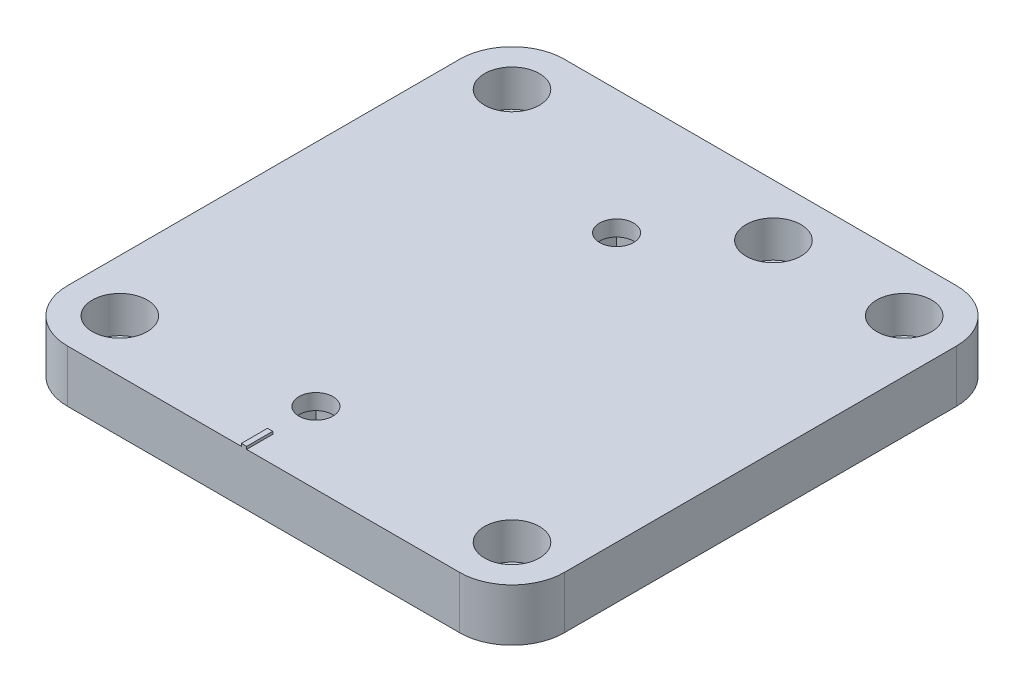
ISO-10303-21;
HEADER;
FILE_DESCRIPTION(('STEP AP214'),'2;1');
FILE_NAME('part.step','',(''),(''),'','','');
FILE_SCHEMA(('AUTOMOTIVE_DESIGN { 1 0 10303 214 1 1 1 1 }'));
ENDSEC;
DATA;
#1=APPLICATION_CONTEXT('core data for automotive mechanical design processes');
#2=APPLICATION_PROTOCOL_DEFINITION('international standard','automotive_design',2000,#1);
#3=PRODUCT_CONTEXT('',#1,'mechanical');
#4=PRODUCT('Part','Part','',(#3));
#5=PRODUCT_RELATED_PRODUCT_CATEGORY('part','',(#4));
#6=PRODUCT_DEFINITION_FORMATION('','',#4);
#7=PRODUCT_DEFINITION_CONTEXT('part definition',#1,'design');
#8=PRODUCT_DEFINITION('design','',#6,#7);
#9=PRODUCT_DEFINITION_SHAPE('','',#8);
#10=(LENGTH_UNIT() NAMED_UNIT(*) SI_UNIT(.MILLI.,.METRE.));
#11=(NAMED_UNIT(*) PLANE_ANGLE_UNIT() SI_UNIT($,.RADIAN.));
#12=(NAMED_UNIT(*) SI_UNIT($,.STERADIAN.) SOLID_ANGLE_UNIT());
#13=UNCERTAINTY_MEASURE_WITH_UNIT(LENGTH_MEASURE(1.E-05),#10,'distance_accuracy_value','');
#14=(GEOMETRIC_REPRESENTATION_CONTEXT(3) GLOBAL_UNCERTAINTY_ASSIGNED_CONTEXT((#13)) GLOBAL_UNIT_ASSIGNED_CONTEXT((#10,
#11,#12)) REPRESENTATION_CONTEXT('',''));
#15=CARTESIAN_POINT('',(0.,0.,0.));
#16=DIRECTION('',(0.,0.,1.));
#17=DIRECTION('',(1.,0.,0.));
#18=AXIS2_PLACEMENT_3D('',#15,#16,#17);
#19=CARTESIAN_POINT('',(-33.75,10.,8.75));
#20=DIRECTION('',(0.,-1.,0.));
#21=DIRECTION('',(0.,0.,-1.));
#22=AXIS2_PLACEMENT_3D('',#19,#20,#21);
#23=CYLINDRICAL_SURFACE('',#22,3.2);
#24=CARTESIAN_POINT('',(-33.75,0.,8.75));
#25=DIRECTION('',(0.,1.,0.));
#26=DIRECTION('',(0.,0.,1.));
#27=AXIS2_PLACEMENT_3D('',#24,#25,#26);
#28=CIRCLE('',#27,3.2);
#29=CARTESIAN_POINT('',(-33.75,0.,11.95));
#30=VERTEX_POINT('',#29);
#31=EDGE_CURVE('E315',#30,#30,#28,.T.);
#32=ORIENTED_EDGE('',*,*,#31,.F.);
#33=EDGE_LOOP('',(#32));
#34=FACE_BOUND('',#33,.T.);
#35=CARTESIAN_POINT('',(-33.75,3.,8.75));
#36=DIRECTION('',(0.,1.,0.));
#37=DIRECTION('',(0.,0.,1.));
#38=AXIS2_PLACEMENT_3D('',#35,#36,#37);
#39=CIRCLE('',#38,3.2);
#40=CARTESIAN_POINT('',(-33.75,3.,11.95));
#41=VERTEX_POINT('',#40);
#42=EDGE_CURVE('E302',#41,#41,#39,.T.);
#43=ORIENTED_EDGE('',*,*,#42,.T.);
#44=EDGE_LOOP('',(#43));
#45=FACE_BOUND('',#44,.T.);
#46=ADVANCED_FACE('F35',(#34,#45),#23,.F.);
#47=CARTESIAN_POINT('',(41.25,10.,8.75));
#48=DIRECTION('',(0.,-1.,0.));
#49=DIRECTION('',(0.,0.,-1.));
#50=AXIS2_PLACEMENT_3D('',#47,#48,#49);
#51=CYLINDRICAL_SURFACE('',#50,3.2);
#52=CARTESIAN_POINT('',(41.25,0.,8.75));
#53=DIRECTION('',(0.,1.,0.));
#54=DIRECTION('',(0.,0.,1.));
#55=AXIS2_PLACEMENT_3D('',#52,#53,#54);
#56=CIRCLE('',#55,3.2);
#57=CARTESIAN_POINT('',(41.25,0.,11.95));
#58=VERTEX_POINT('',#57);
#59=EDGE_CURVE('E312',#58,#58,#56,.T.);
#60=ORIENTED_EDGE('',*,*,#59,.F.);
#61=EDGE_LOOP('',(#60));
#62=FACE_BOUND('',#61,.T.);
#63=CARTESIAN_POINT('',(41.25,3.,8.75));
#64=DIRECTION('',(0.,1.,0.));
#65=DIRECTION('',(0.,0.,1.));
#66=AXIS2_PLACEMENT_3D('',#63,#64,#65);
#67=CIRCLE('',#66,3.2);
#68=CARTESIAN_POINT('',(41.25,3.,11.95));
#69=VERTEX_POINT('',#68);
#70=EDGE_CURVE('E353',#69,#69,#67,.T.);
#71=ORIENTED_EDGE('',*,*,#70,.T.);
#72=EDGE_LOOP('',(#71));
#73=FACE_BOUND('',#72,.T.);
#74=ADVANCED_FACE('F439',(#62,#73),#51,.F.);
#75=CARTESIAN_POINT('',(41.25,10.,83.75));
#76=DIRECTION('',(0.,-1.,0.));
#77=DIRECTION('',(0.,0.,-1.));
#78=AXIS2_PLACEMENT_3D('',#75,#76,#77);
#79=CYLINDRICAL_SURFACE('',#78,3.2);
#80=CARTESIAN_POINT('',(41.25,0.,83.75));
#81=DIRECTION('',(0.,1.,0.));
#82=DIRECTION('',(0.,0.,1.));
#83=AXIS2_PLACEMENT_3D('',#80,#81,#82);
#84=CIRCLE('',#83,3.2);
#85=CARTESIAN_POINT('',(41.25,0.,86.95));
#86=VERTEX_POINT('',#85);
#87=EDGE_CURVE('E309',#86,#86,#84,.T.);
#88=ORIENTED_EDGE('',*,*,#87,.F.);
#89=EDGE_LOOP('',(#88));
#90=FACE_BOUND('',#89,.T.);
#91=CARTESIAN_POINT('',(41.25,3.,83.75));
#92=DIRECTION('',(0.,1.,0.));
#93=DIRECTION('',(0.,0.,1.));
#94=AXIS2_PLACEMENT_3D('',#91,#92,#93);
#95=CIRCLE('',#94,3.2);
#96=CARTESIAN_POINT('',(41.25,3.,86.95));
#97=VERTEX_POINT('',#96);
#98=EDGE_CURVE('E350',#97,#97,#95,.T.);
#99=ORIENTED_EDGE('',*,*,#98,.T.);
#100=EDGE_LOOP('',(#99));
#101=FACE_BOUND('',#100,.T.);
#102=ADVANCED_FACE('F445',(#90,#101),#79,.F.);
#103=CARTESIAN_POINT('',(-33.75,10.,83.75));
#104=DIRECTION('',(0.,-1.,0.));
#105=DIRECTION('',(0.,0.,-1.));
#106=AXIS2_PLACEMENT_3D('',#103,#104,#105);
#107=CYLINDRICAL_SURFACE('',#106,3.19999999999999);
#108=CARTESIAN_POINT('',(-33.75,0.,83.75));
#109=DIRECTION('',(0.,1.,0.));
#110=DIRECTION('',(0.,0.,1.));
#111=AXIS2_PLACEMENT_3D('',#108,#109,#110);
#112=CIRCLE('',#111,3.19999999999999);
#113=CARTESIAN_POINT('',(-33.75,0.,86.95));
#114=VERTEX_POINT('',#113);
#115=EDGE_CURVE('E306',#114,#114,#112,.T.);
#116=ORIENTED_EDGE('',*,*,#115,.F.);
#117=EDGE_LOOP('',(#116));
#118=FACE_BOUND('',#117,.T.);
#119=CARTESIAN_POINT('',(-33.75,3.,83.75));
#120=DIRECTION('',(0.,1.,0.));
#121=DIRECTION('',(0.,0.,1.));
#122=AXIS2_PLACEMENT_3D('',#119,#120,#121);
#123=CIRCLE('',#122,3.19999999999999);
#124=CARTESIAN_POINT('',(-33.75,3.,86.95));
#125=VERTEX_POINT('',#124);
#126=EDGE_CURVE('E281',#125,#125,#123,.T.);
#127=ORIENTED_EDGE('',*,*,#126,.T.);
#128=EDGE_LOOP('',(#127));
#129=FACE_BOUND('',#128,.T.);
#130=ADVANCED_FACE('F455',(#118,#129),#107,.F.);
#131=CARTESIAN_POINT('',(16.25,10.,8.75));
#132=DIRECTION('',(0.,-1.,0.));
#133=DIRECTION('',(0.,0.,-1.));
#134=AXIS2_PLACEMENT_3D('',#131,#132,#133);
#135=CYLINDRICAL_SURFACE('',#134,3.2);
#136=CARTESIAN_POINT('',(16.25,0.,8.75));
#137=DIRECTION('',(0.,1.,0.));
#138=DIRECTION('',(0.,0.,1.));
#139=AXIS2_PLACEMENT_3D('',#136,#137,#138);
#140=CIRCLE('',#139,3.2);
#141=CARTESIAN_POINT('',(16.25,0.,11.95));
#142=VERTEX_POINT('',#141);
#143=EDGE_CURVE('E318',#142,#142,#140,.T.);
#144=ORIENTED_EDGE('',*,*,#143,.F.);
#145=EDGE_LOOP('',(#144));
#146=FACE_BOUND('',#145,.T.);
#147=CARTESIAN_POINT('',(16.25,3.,8.75));
#148=DIRECTION('',(0.,1.,0.));
#149=DIRECTION('',(0.,0.,1.));
#150=AXIS2_PLACEMENT_3D('',#147,#148,#149);
#151=CIRCLE('',#150,3.2);
#152=CARTESIAN_POINT('',(16.25,3.,11.95));
#153=VERTEX_POINT('',#152);
#154=EDGE_CURVE('E305',#153,#153,#151,.T.);
#155=ORIENTED_EDGE('',*,*,#154,.T.);
#156=EDGE_LOOP('',(#155));
#157=FACE_BOUND('',#156,.T.);
#158=ADVANCED_FACE('F452',(#146,#157),#135,.F.);
#159=CARTESIAN_POINT('',(0.,10.,0.));
#160=DIRECTION('',(0.,1.,0.));
#161=DIRECTION('',(0.,0.,1.));
#162=AXIS2_PLACEMENT_3D('',#159,#160,#161);
#163=PLANE('',#162);
#164=DIRECTION('',(0.,0.,-1.));
#165=VECTOR('',#164,1.);
#166=CARTESIAN_POINT('',(0.5,10.,93.75));
#167=LINE('',#166,#165);
#168=CARTESIAN_POINT('',(0.5,10.,93.75));
#169=VERTEX_POINT('',#168);
#170=CARTESIAN_POINT('',(0.5,10.,88.75));
#171=VERTEX_POINT('',#170);
#172=EDGE_CURVE('E55',#169,#171,#167,.T.);
#173=ORIENTED_EDGE('',*,*,#172,.F.);
#174=DIRECTION('',(1.,0.,0.));
#175=VECTOR('',#174,1.);
#176=CARTESIAN_POINT('',(-43.75,10.,93.75));
#177=LINE('',#176,#175);
#178=CARTESIAN_POINT('',(41.25,10.,93.75));
#179=VERTEX_POINT('',#178);
#180=EDGE_CURVE('E329',#169,#179,#177,.T.);
#181=ORIENTED_EDGE('',*,*,#180,.T.);
#182=CARTESIAN_POINT('',(41.25,10.,83.75));
#183=DIRECTION('',(0.,1.,0.));
#184=DIRECTION('',(0.,0.,1.));
#185=AXIS2_PLACEMENT_3D('',#182,#183,#184);
#186=CIRCLE('',#185,10.);
#187=CARTESIAN_POINT('',(51.25,10.,83.75));
#188=VERTEX_POINT('',#187);
#189=EDGE_CURVE('E377',#179,#188,#186,.T.);
#190=ORIENTED_EDGE('',*,*,#189,.T.);
#191=DIRECTION('',(0.,0.,-1.));
#192=VECTOR('',#191,1.);
#193=CARTESIAN_POINT('',(51.25,10.,-1.25000000000001));
#194=LINE('',#193,#192);
#195=CARTESIAN_POINT('',(51.25,10.,8.74999999999999));
#196=VERTEX_POINT('',#195);
#197=EDGE_CURVE('E332',#188,#196,#194,.T.);
#198=ORIENTED_EDGE('',*,*,#197,.T.);
#199=CARTESIAN_POINT('',(41.25,10.,8.74999999999999));
#200=DIRECTION('',(0.,1.,0.));
#201=DIRECTION('',(0.,0.,1.));
#202=AXIS2_PLACEMENT_3D('',#199,#200,#201);
#203=CIRCLE('',#202,10.);
#204=CARTESIAN_POINT('',(41.25,10.,-1.25000000000001));
#205=VERTEX_POINT('',#204);
#206=EDGE_CURVE('E381',#196,#205,#203,.T.);
#207=ORIENTED_EDGE('',*,*,#206,.T.);
#208=DIRECTION('',(-1.,0.,0.));
#209=VECTOR('',#208,1.);
#210=CARTESIAN_POINT('',(51.25,10.,-1.25000000000001));
#211=LINE('',#210,#209);
#212=CARTESIAN_POINT('',(-33.75,10.,-1.25));
#213=VERTEX_POINT('',#212);
#214=EDGE_CURVE('E322',#205,#213,#211,.T.);
#215=ORIENTED_EDGE('',*,*,#214,.T.);
#216=CARTESIAN_POINT('',(-33.75,10.,8.75));
#217=DIRECTION('',(0.,1.,0.));
#218=DIRECTION('',(0.,0.,1.));
#219=AXIS2_PLACEMENT_3D('',#216,#217,#218);
#220=CIRCLE('',#219,10.);
#221=CARTESIAN_POINT('',(-43.75,10.,8.75));
#222=VERTEX_POINT('',#221);
#223=EDGE_CURVE('E379',#213,#222,#220,.T.);
#224=ORIENTED_EDGE('',*,*,#223,.T.);
#225=DIRECTION('',(0.,0.,1.));
#226=VECTOR('',#225,1.);
#227=CARTESIAN_POINT('',(-43.75,10.,-1.25));
#228=LINE('',#227,#226);
#229=CARTESIAN_POINT('',(-43.75,10.,83.75));
#230=VERTEX_POINT('',#229);
#231=EDGE_CURVE('E325',#222,#230,#228,.T.);
#232=ORIENTED_EDGE('',*,*,#231,.T.);
#233=CARTESIAN_POINT('',(-33.75,10.,83.75));
#234=DIRECTION('',(0.,1.,0.));
#235=DIRECTION('',(0.,0.,1.));
#236=AXIS2_PLACEMENT_3D('',#233,#234,#235);
#237=CIRCLE('',#236,10.);
#238=CARTESIAN_POINT('',(-33.75,10.,93.75));
#239=VERTEX_POINT('',#238);
#240=EDGE_CURVE('E375',#230,#239,#237,.T.);
#241=ORIENTED_EDGE('',*,*,#240,.T.);
#242=CARTESIAN_POINT('',(-0.5,10.,93.75));
#243=VERTEX_POINT('',#242);
#244=EDGE_CURVE('E330',#239,#243,#177,.T.);
#245=ORIENTED_EDGE('',*,*,#244,.T.);
#246=DIRECTION('',(0.,0.,1.));
#247=VECTOR('',#246,1.);
#248=CARTESIAN_POINT('',(-0.5,10.,93.75));
#249=LINE('',#248,#247);
#250=CARTESIAN_POINT('',(-0.5,10.,88.75));
#251=VERTEX_POINT('',#250);
#252=EDGE_CURVE('E189',#251,#243,#249,.T.);
#253=ORIENTED_EDGE('',*,*,#252,.F.);
#254=DIRECTION('',(-1.,0.,0.));
#255=VECTOR('',#254,1.);
#256=CARTESIAN_POINT('',(0.5,10.,88.75));
#257=LINE('',#256,#255);
#258=EDGE_CURVE('E50',#171,#251,#257,.T.);
#259=ORIENTED_EDGE('',*,*,#258,.F.);
#260=EDGE_LOOP('',(#173,#181,#190,#198,#207,#215,#224,#232,#241,#245,#253,#259));
#261=FACE_BOUND('',#260,.T.);
#262=CARTESIAN_POINT('',(0.,10.,80.));
#263=DIRECTION('',(0.,1.,0.));
#264=DIRECTION('',(0.,0.,1.));
#265=AXIS2_PLACEMENT_3D('',#262,#263,#264);
#266=CIRCLE('',#265,3.25);
#267=CARTESIAN_POINT('',(0.,10.,83.25));
#268=VERTEX_POINT('',#267);
#269=EDGE_CURVE('E248',#268,#268,#266,.T.);
#270=ORIENTED_EDGE('',*,*,#269,.F.);
#271=EDGE_LOOP('',(#270));
#272=FACE_BOUND('',#271,.T.);
#273=CARTESIAN_POINT('',(0.,10.,22.5));
#274=DIRECTION('',(0.,1.,0.));
#275=DIRECTION('',(0.,0.,1.));
#276=AXIS2_PLACEMENT_3D('',#273,#274,#275);
#277=CIRCLE('',#276,3.25);
#278=CARTESIAN_POINT('',(0.,10.,25.75));
#279=VERTEX_POINT('',#278);
#280=EDGE_CURVE('E270',#279,#279,#277,.T.);
#281=ORIENTED_EDGE('',*,*,#280,.F.);
#282=EDGE_LOOP('',(#281));
#283=FACE_BOUND('',#282,.T.);
#284=CARTESIAN_POINT('',(-33.75,10.,8.75));
#285=DIRECTION('',(0.,1.,0.));
#286=DIRECTION('',(0.,0.,1.));
#287=AXIS2_PLACEMENT_3D('',#284,#285,#286);
#288=CIRCLE('',#287,5.25);
#289=CARTESIAN_POINT('',(-33.75,10.,14.));
#290=VERTEX_POINT('',#289);
#291=EDGE_CURVE('E274',#290,#290,#288,.T.);
#292=ORIENTED_EDGE('',*,*,#291,.F.);
#293=EDGE_LOOP('',(#292));
#294=FACE_BOUND('',#293,.T.);
#295=CARTESIAN_POINT('',(41.25,10.,8.75));
#296=DIRECTION('',(0.,1.,0.));
#297=DIRECTION('',(0.,0.,1.));
#298=AXIS2_PLACEMENT_3D('',#295,#296,#297);
#299=CIRCLE('',#298,5.25);
#300=CARTESIAN_POINT('',(41.25,10.,14.));
#301=VERTEX_POINT('',#300);
#302=EDGE_CURVE('E282',#301,#301,#299,.T.);
#303=ORIENTED_EDGE('',*,*,#302,.F.);
#304=EDGE_LOOP('',(#303));
#305=FACE_BOUND('',#304,.T.);
#306=CARTESIAN_POINT('',(41.25,10.,83.75));
#307=DIRECTION('',(0.,1.,0.));
#308=DIRECTION('',(0.,0.,1.));
#309=AXIS2_PLACEMENT_3D('',#306,#307,#308);
#310=CIRCLE('',#309,5.25);
#311=CARTESIAN_POINT('',(41.25,10.,89.));
#312=VERTEX_POINT('',#311);
#313=EDGE_CURVE('E288',#312,#312,#310,.T.);
#314=ORIENTED_EDGE('',*,*,#313,.F.);
#315=EDGE_LOOP('',(#314));
#316=FACE_BOUND('',#315,.T.);
#317=CARTESIAN_POINT('',(-33.75,10.,83.75));
#318=DIRECTION('',(0.,1.,0.));
#319=DIRECTION('',(0.,0.,1.));
#320=AXIS2_PLACEMENT_3D('',#317,#318,#319);
#321=CIRCLE('',#320,5.25);
#322=CARTESIAN_POINT('',(-33.75,10.,89.));
#323=VERTEX_POINT('',#322);
#324=EDGE_CURVE('E273',#323,#323,#321,.T.);
#325=ORIENTED_EDGE('',*,*,#324,.F.);
#326=EDGE_LOOP('',(#325));
#327=FACE_BOUND('',#326,.T.);
#328=CARTESIAN_POINT('',(16.25,10.,8.75));
#329=DIRECTION('',(0.,1.,0.));
#330=DIRECTION('',(0.,0.,1.));
#331=AXIS2_PLACEMENT_3D('',#328,#329,#330);
#332=CIRCLE('',#331,5.25);
#333=CARTESIAN_POINT('',(16.25,10.,14.));
#334=VERTEX_POINT('',#333);
#335=EDGE_CURVE('E298',#334,#334,#332,.T.);
#336=ORIENTED_EDGE('',*,*,#335,.F.);
#337=EDGE_LOOP('',(#336));
#338=FACE_BOUND('',#337,.T.);
#339=ADVANCED_FACE('F412',(#261,#272,#283,#294,#305,#316,#327,#338),#163,.T.);
#340=CARTESIAN_POINT('',(0.,0.,0.));
#341=DIRECTION('',(0.,1.,0.));
#342=DIRECTION('',(0.,0.,1.));
#343=AXIS2_PLACEMENT_3D('',#340,#341,#342);
#344=PLANE('',#343);
#345=DIRECTION('',(1.,0.,0.));
#346=VECTOR('',#345,1.);
#347=CARTESIAN_POINT('',(-5.19999999999999,0.,74.8));
#348=LINE('',#347,#346);
#349=CARTESIAN_POINT('',(-5.19999999999999,0.,74.8));
#350=VERTEX_POINT('',#349);
#351=CARTESIAN_POINT('',(5.19999999999999,0.,74.8));
#352=VERTEX_POINT('',#351);
#353=EDGE_CURVE('E208',#350,#352,#348,.T.);
#354=ORIENTED_EDGE('',*,*,#353,.F.);
#355=DIRECTION('',(0.,0.,-1.));
#356=VECTOR('',#355,1.);
#357=CARTESIAN_POINT('',(-5.19999999999999,0.,74.8));
#358=LINE('',#357,#356);
#359=CARTESIAN_POINT('',(-5.19999999999999,0.,85.2));
#360=VERTEX_POINT('',#359);
#361=EDGE_CURVE('E211',#360,#350,#358,.T.);
#362=ORIENTED_EDGE('',*,*,#361,.F.);
#363=DIRECTION('',(-1.,0.,0.));
#364=VECTOR('',#363,1.);
#365=CARTESIAN_POINT('',(-5.19999999999999,0.,85.2));
#366=LINE('',#365,#364);
#367=CARTESIAN_POINT('',(5.19999999999999,0.,85.2));
#368=VERTEX_POINT('',#367);
#369=EDGE_CURVE('E201',#368,#360,#366,.T.);
#370=ORIENTED_EDGE('',*,*,#369,.F.);
#371=DIRECTION('',(0.,0.,1.));
#372=VECTOR('',#371,1.);
#373=CARTESIAN_POINT('',(5.19999999999999,0.,74.8));
#374=LINE('',#373,#372);
#375=EDGE_CURVE('E205',#352,#368,#374,.T.);
#376=ORIENTED_EDGE('',*,*,#375,.F.);
#377=EDGE_LOOP('',(#354,#362,#370,#376));
#378=FACE_BOUND('',#377,.T.);
#379=DIRECTION('',(-1.,0.,0.));
#380=VECTOR('',#379,1.);
#381=CARTESIAN_POINT('',(5.2,0.,27.7));
#382=LINE('',#381,#380);
#383=CARTESIAN_POINT('',(5.2,0.,27.7));
#384=VERTEX_POINT('',#383);
#385=CARTESIAN_POINT('',(-5.2,0.,27.7));
#386=VERTEX_POINT('',#385);
#387=EDGE_CURVE('E240',#384,#386,#382,.T.);
#388=ORIENTED_EDGE('',*,*,#387,.F.);
#389=DIRECTION('',(0.,0.,1.));
#390=VECTOR('',#389,1.);
#391=CARTESIAN_POINT('',(5.2,0.,27.7));
#392=LINE('',#391,#390);
#393=CARTESIAN_POINT('',(5.2,0.,17.3));
#394=VERTEX_POINT('',#393);
#395=EDGE_CURVE('E243',#394,#384,#392,.T.);
#396=ORIENTED_EDGE('',*,*,#395,.F.);
#397=DIRECTION('',(1.,0.,0.));
#398=VECTOR('',#397,1.);
#399=CARTESIAN_POINT('',(5.2,0.,17.3));
#400=LINE('',#399,#398);
#401=CARTESIAN_POINT('',(-5.2,0.,17.3));
#402=VERTEX_POINT('',#401);
#403=EDGE_CURVE('E233',#402,#394,#400,.T.);
#404=ORIENTED_EDGE('',*,*,#403,.F.);
#405=DIRECTION('',(0.,0.,-1.));
#406=VECTOR('',#405,1.);
#407=CARTESIAN_POINT('',(-5.2,0.,27.7));
#408=LINE('',#407,#406);
#409=EDGE_CURVE('E237',#386,#402,#408,.T.);
#410=ORIENTED_EDGE('',*,*,#409,.F.);
#411=EDGE_LOOP('',(#388,#396,#404,#410));
#412=FACE_BOUND('',#411,.T.);
#413=DIRECTION('',(-1.,0.,0.));
#414=VECTOR('',#413,1.);
#415=CARTESIAN_POINT('',(51.25,0.,-1.25000000000001));
#416=LINE('',#415,#414);
#417=CARTESIAN_POINT('',(41.25,0.,-1.25000000000001));
#418=VERTEX_POINT('',#417);
#419=CARTESIAN_POINT('',(-33.75,0.,-1.25));
#420=VERTEX_POINT('',#419);
#421=EDGE_CURVE('E321',#418,#420,#416,.T.);
#422=ORIENTED_EDGE('',*,*,#421,.F.);
#423=CARTESIAN_POINT('',(41.25,0.,8.74999999999999));
#424=DIRECTION('',(0.,1.,0.));
#425=DIRECTION('',(0.,0.,1.));
#426=AXIS2_PLACEMENT_3D('',#423,#424,#425);
#427=CIRCLE('',#426,10.);
#428=CARTESIAN_POINT('',(51.25,0.,8.74999999999999));
#429=VERTEX_POINT('',#428);
#430=EDGE_CURVE('E368',#418,#429,#427,.F.);
#431=ORIENTED_EDGE('',*,*,#430,.T.);
#432=DIRECTION('',(0.,0.,-1.));
#433=VECTOR('',#432,1.);
#434=CARTESIAN_POINT('',(51.25,0.,-1.25000000000001));
#435=LINE('',#434,#433);
#436=CARTESIAN_POINT('',(51.25,0.,83.75));
#437=VERTEX_POINT('',#436);
#438=EDGE_CURVE('E326',#437,#429,#435,.T.);
#439=ORIENTED_EDGE('',*,*,#438,.F.);
#440=CARTESIAN_POINT('',(41.25,0.,83.75));
#441=DIRECTION('',(0.,1.,0.));
#442=DIRECTION('',(0.,0.,1.));
#443=AXIS2_PLACEMENT_3D('',#440,#441,#442);
#444=CIRCLE('',#443,10.);
#445=CARTESIAN_POINT('',(41.25,0.,93.75));
#446=VERTEX_POINT('',#445);
#447=EDGE_CURVE('E364',#437,#446,#444,.F.);
#448=ORIENTED_EDGE('',*,*,#447,.T.);
#449=DIRECTION('',(1.,0.,0.));
#450=VECTOR('',#449,1.);
#451=CARTESIAN_POINT('',(-43.75,0.,93.75));
#452=LINE('',#451,#450);
#453=CARTESIAN_POINT('',(-33.75,0.,93.75));
#454=VERTEX_POINT('',#453);
#455=EDGE_CURVE('E341',#454,#446,#452,.T.);
#456=ORIENTED_EDGE('',*,*,#455,.F.);
#457=CARTESIAN_POINT('',(-33.75,0.,83.75));
#458=DIRECTION('',(0.,1.,0.));
#459=DIRECTION('',(0.,0.,1.));
#460=AXIS2_PLACEMENT_3D('',#457,#458,#459);
#461=CIRCLE('',#460,10.);
#462=CARTESIAN_POINT('',(-43.75,0.,83.75));
#463=VERTEX_POINT('',#462);
#464=EDGE_CURVE('E362',#454,#463,#461,.F.);
#465=ORIENTED_EDGE('',*,*,#464,.T.);
#466=DIRECTION('',(0.,0.,1.));
#467=VECTOR('',#466,1.);
#468=CARTESIAN_POINT('',(-43.75,0.,-1.25));
#469=LINE('',#468,#467);
#470=CARTESIAN_POINT('',(-43.75,0.,8.75));
#471=VERTEX_POINT('',#470);
#472=EDGE_CURVE('E338',#471,#463,#469,.T.);
#473=ORIENTED_EDGE('',*,*,#472,.F.);
#474=CARTESIAN_POINT('',(-33.75,0.,8.75));
#475=DIRECTION('',(0.,1.,0.));
#476=DIRECTION('',(0.,0.,1.));
#477=AXIS2_PLACEMENT_3D('',#474,#475,#476);
#478=CIRCLE('',#477,10.);
#479=EDGE_CURVE('E366',#471,#420,#478,.F.);
#480=ORIENTED_EDGE('',*,*,#479,.T.);
#481=EDGE_LOOP('',(#422,#431,#439,#448,#456,#465,#473,#480));
#482=FACE_BOUND('',#481,.T.);
#483=ORIENTED_EDGE('',*,*,#143,.T.);
#484=EDGE_LOOP('',(#483));
#485=FACE_BOUND('',#484,.T.);
#486=ORIENTED_EDGE('',*,*,#31,.T.);
#487=EDGE_LOOP('',(#486));
#488=FACE_BOUND('',#487,.T.);
#489=ORIENTED_EDGE('',*,*,#59,.T.);
#490=EDGE_LOOP('',(#489));
#491=FACE_BOUND('',#490,.T.);
#492=ORIENTED_EDGE('',*,*,#87,.T.);
#493=EDGE_LOOP('',(#492));
#494=FACE_BOUND('',#493,.T.);
#495=ORIENTED_EDGE('',*,*,#115,.T.);
#496=EDGE_LOOP('',(#495));
#497=FACE_BOUND('',#496,.T.);
#498=ADVANCED_FACE('F399',(#378,#412,#482,#485,#488,#491,#494,#497),#344,.F.);
#499=CARTESIAN_POINT('',(51.25,10.,-1.25000000000001));
#500=DIRECTION('',(0.,0.,1.));
#501=DIRECTION('',(1.,0.,0.));
#502=AXIS2_PLACEMENT_3D('',#499,#500,#501);
#503=PLANE('',#502);
#504=ORIENTED_EDGE('',*,*,#214,.F.);
#505=DIRECTION('',(0.,-1.,0.));
#506=VECTOR('',#505,1.);
#507=CARTESIAN_POINT('',(41.25,10.,-1.25000000000001));
#508=LINE('',#507,#506);
#509=EDGE_CURVE('E359',#205,#418,#508,.T.);
#510=ORIENTED_EDGE('',*,*,#509,.T.);
#511=ORIENTED_EDGE('',*,*,#421,.T.);
#512=DIRECTION('',(0.,-1.,0.));
#513=VECTOR('',#512,1.);
#514=CARTESIAN_POINT('',(-33.75,10.,-1.25));
#515=LINE('',#514,#513);
#516=EDGE_CURVE('E335',#420,#213,#515,.F.);
#517=ORIENTED_EDGE('',*,*,#516,.T.);
#518=EDGE_LOOP('',(#504,#510,#511,#517));
#519=FACE_BOUND('',#518,.T.);
#520=ADVANCED_FACE('F419',(#519),#503,.F.);
#521=CARTESIAN_POINT('',(-43.75,10.,-1.25));
#522=DIRECTION('',(1.,0.,0.));
#523=DIRECTION('',(0.,0.,-1.));
#524=AXIS2_PLACEMENT_3D('',#521,#522,#523);
#525=PLANE('',#524);
#526=ORIENTED_EDGE('',*,*,#231,.F.);
#527=DIRECTION('',(0.,-1.,0.));
#528=VECTOR('',#527,1.);
#529=CARTESIAN_POINT('',(-43.75,10.,8.75));
#530=LINE('',#529,#528);
#531=EDGE_CURVE('E385',#222,#471,#530,.T.);
#532=ORIENTED_EDGE('',*,*,#531,.T.);
#533=ORIENTED_EDGE('',*,*,#472,.T.);
#534=DIRECTION('',(0.,-1.,0.));
#535=VECTOR('',#534,1.);
#536=CARTESIAN_POINT('',(-43.75,10.,83.75));
#537=LINE('',#536,#535);
#538=EDGE_CURVE('E383',#463,#230,#537,.F.);
#539=ORIENTED_EDGE('',*,*,#538,.T.);
#540=EDGE_LOOP('',(#526,#532,#533,#539));
#541=FACE_BOUND('',#540,.T.);
#542=ADVANCED_FACE('F427',(#541),#525,.F.);
#543=CARTESIAN_POINT('',(-43.75,10.,93.75));
#544=DIRECTION('',(0.,0.,-1.));
#545=DIRECTION('',(-1.,0.,0.));
#546=AXIS2_PLACEMENT_3D('',#543,#544,#545);
#547=PLANE('',#546);
#548=ORIENTED_EDGE('',*,*,#455,.T.);
#549=DIRECTION('',(0.,-1.,0.));
#550=VECTOR('',#549,1.);
#551=CARTESIAN_POINT('',(41.25,10.,93.75));
#552=LINE('',#551,#550);
#553=EDGE_CURVE('E12',#446,#179,#552,.F.);
#554=ORIENTED_EDGE('',*,*,#553,.T.);
#555=ORIENTED_EDGE('',*,*,#180,.F.);
#556=DIRECTION('',(0.,-1.,0.));
#557=VECTOR('',#556,1.);
#558=CARTESIAN_POINT('',(0.5,10.5,93.75));
#559=LINE('',#558,#557);
#560=CARTESIAN_POINT('',(0.5,10.5,93.75));
#561=VERTEX_POINT('',#560);
#562=EDGE_CURVE('E857',#561,#169,#559,.T.);
#563=ORIENTED_EDGE('',*,*,#562,.F.);
#564=DIRECTION('',(1.,0.,0.));
#565=VECTOR('',#564,1.);
#566=CARTESIAN_POINT('',(0.5,10.5,93.75));
#567=LINE('',#566,#565);
#568=CARTESIAN_POINT('',(-0.5,10.5,93.75));
#569=VERTEX_POINT('',#568);
#570=EDGE_CURVE('E185',#569,#561,#567,.T.);
#571=ORIENTED_EDGE('',*,*,#570,.F.);
#572=DIRECTION('',(0.,-1.,0.));
#573=VECTOR('',#572,1.);
#574=CARTESIAN_POINT('',(-0.5,10.5,93.75));
#575=LINE('',#574,#573);
#576=EDGE_CURVE('E197',#569,#243,#575,.T.);
#577=ORIENTED_EDGE('',*,*,#576,.T.);
#578=ORIENTED_EDGE('',*,*,#244,.F.);
#579=DIRECTION('',(0.,-1.,0.));
#580=VECTOR('',#579,1.);
#581=CARTESIAN_POINT('',(-33.75,10.,93.75));
#582=LINE('',#581,#580);
#583=EDGE_CURVE('E43',#239,#454,#582,.T.);
#584=ORIENTED_EDGE('',*,*,#583,.T.);
#585=EDGE_LOOP('',(#548,#554,#555,#563,#571,#577,#578,#584));
#586=FACE_BOUND('',#585,.T.);
#587=ADVANCED_FACE('F392',(#586),#547,.F.);
#588=CARTESIAN_POINT('',(51.25,10.,-1.25000000000001));
#589=DIRECTION('',(-1.,0.,0.));
#590=DIRECTION('',(0.,0.,1.));
#591=AXIS2_PLACEMENT_3D('',#588,#589,#590);
#592=PLANE('',#591);
#593=ORIENTED_EDGE('',*,*,#438,.T.);
#594=DIRECTION('',(0.,-1.,0.));
#595=VECTOR('',#594,1.);
#596=CARTESIAN_POINT('',(51.25,10.,8.74999999999999));
#597=LINE('',#596,#595);
#598=EDGE_CURVE('E373',#429,#196,#597,.F.);
#599=ORIENTED_EDGE('',*,*,#598,.T.);
#600=ORIENTED_EDGE('',*,*,#197,.F.);
#601=DIRECTION('',(0.,-1.,0.));
#602=VECTOR('',#601,1.);
#603=CARTESIAN_POINT('',(51.25,10.,83.75));
#604=LINE('',#603,#602);
#605=EDGE_CURVE('E370',#188,#437,#604,.T.);
#606=ORIENTED_EDGE('',*,*,#605,.T.);
#607=EDGE_LOOP('',(#593,#599,#600,#606));
#608=FACE_BOUND('',#607,.T.);
#609=ADVANCED_FACE('F409',(#608),#592,.F.);
#610=CARTESIAN_POINT('',(16.25,-14.8492424049175,8.75));
#611=DIRECTION('',(0.,1.,0.));
#612=DIRECTION('',(0.,0.,1.));
#613=AXIS2_PLACEMENT_3D('',#610,#611,#612);
#614=CYLINDRICAL_SURFACE('',#613,5.25);
#615=CARTESIAN_POINT('',(16.25,3.,8.75));
#616=DIRECTION('',(0.,1.,0.));
#617=DIRECTION('',(0.,0.,1.));
#618=AXIS2_PLACEMENT_3D('',#615,#616,#617);
#619=CIRCLE('',#618,5.25);
#620=CARTESIAN_POINT('',(16.25,3.,14.));
#621=VERTEX_POINT('',#620);
#622=EDGE_CURVE('E301',#621,#621,#619,.F.);
#623=ORIENTED_EDGE('',*,*,#622,.T.);
#624=EDGE_LOOP('',(#623));
#625=FACE_BOUND('',#624,.T.);
#626=ORIENTED_EDGE('',*,*,#335,.T.);
#627=EDGE_LOOP('',(#626));
#628=FACE_BOUND('',#627,.T.);
#629=ADVANCED_FACE('F464',(#625,#628),#614,.F.);
#630=CARTESIAN_POINT('',(0.,3.,0.));
#631=DIRECTION('',(0.,1.,0.));
#632=DIRECTION('',(0.,0.,1.));
#633=AXIS2_PLACEMENT_3D('',#630,#631,#632);
#634=PLANE('',#633);
#635=ORIENTED_EDGE('',*,*,#154,.F.);
#636=EDGE_LOOP('',(#635));
#637=FACE_BOUND('',#636,.T.);
#638=ORIENTED_EDGE('',*,*,#622,.F.);
#639=EDGE_LOOP('',(#638));
#640=FACE_BOUND('',#639,.T.);
#641=ADVANCED_FACE('F691',(#637,#640),#634,.T.);
#642=CARTESIAN_POINT('',(-33.75,-14.8492424049175,83.75));
#643=DIRECTION('',(0.,1.,0.));
#644=DIRECTION('',(0.,0.,1.));
#645=AXIS2_PLACEMENT_3D('',#642,#643,#644);
#646=CYLINDRICAL_SURFACE('',#645,5.25);
#647=CARTESIAN_POINT('',(-33.75,3.,83.75));
#648=DIRECTION('',(0.,1.,0.));
#649=DIRECTION('',(0.,0.,1.));
#650=AXIS2_PLACEMENT_3D('',#647,#648,#649);
#651=CIRCLE('',#650,5.25);
#652=CARTESIAN_POINT('',(-33.75,3.,89.));
#653=VERTEX_POINT('',#652);
#654=EDGE_CURVE('E291',#653,#653,#651,.F.);
#655=ORIENTED_EDGE('',*,*,#654,.T.);
#656=EDGE_LOOP('',(#655));
#657=FACE_BOUND('',#656,.T.);
#658=ORIENTED_EDGE('',*,*,#324,.T.);
#659=EDGE_LOOP('',(#658));
#660=FACE_BOUND('',#659,.T.);
#661=ADVANCED_FACE('F687',(#657,#660),#646,.F.);
#662=CARTESIAN_POINT('',(0.,3.,0.));
#663=DIRECTION('',(0.,1.,0.));
#664=DIRECTION('',(0.,0.,1.));
#665=AXIS2_PLACEMENT_3D('',#662,#663,#664);
#666=PLANE('',#665);
#667=ORIENTED_EDGE('',*,*,#126,.F.);
#668=EDGE_LOOP('',(#667));
#669=FACE_BOUND('',#668,.T.);
#670=ORIENTED_EDGE('',*,*,#654,.F.);
#671=EDGE_LOOP('',(#670));
#672=FACE_BOUND('',#671,.T.);
#673=ADVANCED_FACE('F683',(#669,#672),#666,.T.);
#674=CARTESIAN_POINT('',(41.25,-14.8492424049175,83.75));
#675=DIRECTION('',(0.,1.,0.));
#676=DIRECTION('',(0.,0.,1.));
#677=AXIS2_PLACEMENT_3D('',#674,#675,#676);
#678=CYLINDRICAL_SURFACE('',#677,5.25);
#679=CARTESIAN_POINT('',(41.25,3.,83.75));
#680=DIRECTION('',(0.,1.,0.));
#681=DIRECTION('',(0.,0.,1.));
#682=AXIS2_PLACEMENT_3D('',#679,#680,#681);
#683=CIRCLE('',#682,5.25);
#684=CARTESIAN_POINT('',(41.25,3.,89.));
#685=VERTEX_POINT('',#684);
#686=EDGE_CURVE('E285',#685,#685,#683,.F.);
#687=ORIENTED_EDGE('',*,*,#686,.T.);
#688=EDGE_LOOP('',(#687));
#689=FACE_BOUND('',#688,.T.);
#690=ORIENTED_EDGE('',*,*,#313,.T.);
#691=EDGE_LOOP('',(#690));
#692=FACE_BOUND('',#691,.T.);
#693=ADVANCED_FACE('F679',(#689,#692),#678,.F.);
#694=CARTESIAN_POINT('',(0.,3.,0.));
#695=DIRECTION('',(0.,1.,0.));
#696=DIRECTION('',(0.,0.,1.));
#697=AXIS2_PLACEMENT_3D('',#694,#695,#696);
#698=PLANE('',#697);
#699=ORIENTED_EDGE('',*,*,#98,.F.);
#700=EDGE_LOOP('',(#699));
#701=FACE_BOUND('',#700,.T.);
#702=ORIENTED_EDGE('',*,*,#686,.F.);
#703=EDGE_LOOP('',(#702));
#704=FACE_BOUND('',#703,.T.);
#705=ADVANCED_FACE('F675',(#701,#704),#698,.T.);
#706=CARTESIAN_POINT('',(41.25,-14.8492424049175,8.75));
#707=DIRECTION('',(0.,1.,0.));
#708=DIRECTION('',(0.,0.,1.));
#709=AXIS2_PLACEMENT_3D('',#706,#707,#708);
#710=CYLINDRICAL_SURFACE('',#709,5.25);
#711=CARTESIAN_POINT('',(41.25,3.,8.75));
#712=DIRECTION('',(0.,1.,0.));
#713=DIRECTION('',(0.,0.,1.));
#714=AXIS2_PLACEMENT_3D('',#711,#712,#713);
#715=CIRCLE('',#714,5.25);
#716=CARTESIAN_POINT('',(41.25,3.,14.));
#717=VERTEX_POINT('',#716);
#718=EDGE_CURVE('E278',#717,#717,#715,.F.);
#719=ORIENTED_EDGE('',*,*,#718,.T.);
#720=EDGE_LOOP('',(#719));
#721=FACE_BOUND('',#720,.T.);
#722=ORIENTED_EDGE('',*,*,#302,.T.);
#723=EDGE_LOOP('',(#722));
#724=FACE_BOUND('',#723,.T.);
#725=ADVANCED_FACE('F671',(#721,#724),#710,.F.);
#726=CARTESIAN_POINT('',(0.,3.,0.));
#727=DIRECTION('',(0.,1.,0.));
#728=DIRECTION('',(0.,0.,1.));
#729=AXIS2_PLACEMENT_3D('',#726,#727,#728);
#730=PLANE('',#729);
#731=ORIENTED_EDGE('',*,*,#70,.F.);
#732=EDGE_LOOP('',(#731));
#733=FACE_BOUND('',#732,.T.);
#734=ORIENTED_EDGE('',*,*,#718,.F.);
#735=EDGE_LOOP('',(#734));
#736=FACE_BOUND('',#735,.T.);
#737=ADVANCED_FACE('F667',(#733,#736),#730,.T.);
#738=CARTESIAN_POINT('',(-33.75,-14.8492424049175,8.75));
#739=DIRECTION('',(0.,1.,0.));
#740=DIRECTION('',(0.,0.,1.));
#741=AXIS2_PLACEMENT_3D('',#738,#739,#740);
#742=CYLINDRICAL_SURFACE('',#741,5.25);
#743=CARTESIAN_POINT('',(-33.75,3.,8.75));
#744=DIRECTION('',(0.,1.,0.));
#745=DIRECTION('',(0.,0.,1.));
#746=AXIS2_PLACEMENT_3D('',#743,#744,#745);
#747=CIRCLE('',#746,5.25);
#748=CARTESIAN_POINT('',(-33.75,3.,14.));
#749=VERTEX_POINT('',#748);
#750=EDGE_CURVE('E277',#749,#749,#747,.F.);
#751=ORIENTED_EDGE('',*,*,#750,.T.);
#752=EDGE_LOOP('',(#751));
#753=FACE_BOUND('',#752,.T.);
#754=ORIENTED_EDGE('',*,*,#291,.T.);
#755=EDGE_LOOP('',(#754));
#756=FACE_BOUND('',#755,.T.);
#757=ADVANCED_FACE('F663',(#753,#756),#742,.F.);
#758=CARTESIAN_POINT('',(0.,3.,0.));
#759=DIRECTION('',(0.,1.,0.));
#760=DIRECTION('',(0.,0.,1.));
#761=AXIS2_PLACEMENT_3D('',#758,#759,#760);
#762=PLANE('',#761);
#763=ORIENTED_EDGE('',*,*,#42,.F.);
#764=EDGE_LOOP('',(#763));
#765=FACE_BOUND('',#764,.T.);
#766=ORIENTED_EDGE('',*,*,#750,.F.);
#767=EDGE_LOOP('',(#766));
#768=FACE_BOUND('',#767,.T.);
#769=ADVANCED_FACE('F473',(#765,#768),#762,.T.);
#770=CARTESIAN_POINT('',(41.25,10.,8.74999999999999));
#771=DIRECTION('',(0.,-1.,0.));
#772=DIRECTION('',(0.,0.,-1.));
#773=AXIS2_PLACEMENT_3D('',#770,#771,#772);
#774=CYLINDRICAL_SURFACE('',#773,10.);
#775=ORIENTED_EDGE('',*,*,#206,.F.);
#776=ORIENTED_EDGE('',*,*,#598,.F.);
#777=ORIENTED_EDGE('',*,*,#430,.F.);
#778=ORIENTED_EDGE('',*,*,#509,.F.);
#779=EDGE_LOOP('',(#775,#776,#777,#778));
#780=FACE_BOUND('',#779,.T.);
#781=ADVANCED_FACE('F417',(#780),#774,.T.);
#782=CARTESIAN_POINT('',(-33.75,10.,8.75));
#783=DIRECTION('',(0.,-1.,0.));
#784=DIRECTION('',(0.,0.,-1.));
#785=AXIS2_PLACEMENT_3D('',#782,#783,#784);
#786=CYLINDRICAL_SURFACE('',#785,10.);
#787=ORIENTED_EDGE('',*,*,#223,.F.);
#788=ORIENTED_EDGE('',*,*,#516,.F.);
#789=ORIENTED_EDGE('',*,*,#479,.F.);
#790=ORIENTED_EDGE('',*,*,#531,.F.);
#791=EDGE_LOOP('',(#787,#788,#789,#790));
#792=FACE_BOUND('',#791,.T.);
#793=ADVANCED_FACE('F424',(#792),#786,.T.);
#794=CARTESIAN_POINT('',(41.25,10.,83.75));
#795=DIRECTION('',(0.,-1.,0.));
#796=DIRECTION('',(0.,0.,-1.));
#797=AXIS2_PLACEMENT_3D('',#794,#795,#796);
#798=CYLINDRICAL_SURFACE('',#797,10.);
#799=ORIENTED_EDGE('',*,*,#189,.F.);
#800=ORIENTED_EDGE('',*,*,#553,.F.);
#801=ORIENTED_EDGE('',*,*,#447,.F.);
#802=ORIENTED_EDGE('',*,*,#605,.F.);
#803=EDGE_LOOP('',(#799,#800,#801,#802));
#804=FACE_BOUND('',#803,.T.);
#805=ADVANCED_FACE('F406',(#804),#798,.T.);
#806=CARTESIAN_POINT('',(-33.75,10.,83.75));
#807=DIRECTION('',(0.,-1.,0.));
#808=DIRECTION('',(0.,0.,-1.));
#809=AXIS2_PLACEMENT_3D('',#806,#807,#808);
#810=CYLINDRICAL_SURFACE('',#809,10.);
#811=ORIENTED_EDGE('',*,*,#240,.F.);
#812=ORIENTED_EDGE('',*,*,#538,.F.);
#813=ORIENTED_EDGE('',*,*,#464,.F.);
#814=ORIENTED_EDGE('',*,*,#583,.F.);
#815=EDGE_LOOP('',(#811,#812,#813,#814));
#816=FACE_BOUND('',#815,.T.);
#817=ADVANCED_FACE('F37',(#816),#810,.T.);
#818=CARTESIAN_POINT('',(0.,-9.19238815542512,22.5));
#819=DIRECTION('',(0.,1.,0.));
#820=DIRECTION('',(0.,0.,1.));
#821=AXIS2_PLACEMENT_3D('',#818,#819,#820);
#822=CYLINDRICAL_SURFACE('',#821,3.25);
#823=CARTESIAN_POINT('',(0.,7.,22.5));
#824=DIRECTION('',(0.,1.,0.));
#825=DIRECTION('',(0.,0.,1.));
#826=AXIS2_PLACEMENT_3D('',#823,#824,#825);
#827=CIRCLE('',#826,3.25);
#828=CARTESIAN_POINT('',(0.,7.,25.75));
#829=VERTEX_POINT('',#828);
#830=EDGE_CURVE('E236',#829,#829,#827,.F.);
#831=ORIENTED_EDGE('',*,*,#830,.T.);
#832=EDGE_LOOP('',(#831));
#833=FACE_BOUND('',#832,.T.);
#834=ORIENTED_EDGE('',*,*,#280,.T.);
#835=EDGE_LOOP('',(#834));
#836=FACE_BOUND('',#835,.T.);
#837=ADVANCED_FACE('F430',(#833,#836),#822,.F.);
#838=CARTESIAN_POINT('',(0.,-9.19238815542512,80.));
#839=DIRECTION('',(0.,1.,0.));
#840=DIRECTION('',(0.,0.,1.));
#841=AXIS2_PLACEMENT_3D('',#838,#839,#840);
#842=CYLINDRICAL_SURFACE('',#841,3.25);
#843=CARTESIAN_POINT('',(0.,7.,80.));
#844=DIRECTION('',(0.,1.,0.));
#845=DIRECTION('',(0.,0.,1.));
#846=AXIS2_PLACEMENT_3D('',#843,#844,#845);
#847=CIRCLE('',#846,3.25);
#848=CARTESIAN_POINT('',(0.,7.,83.25));
#849=VERTEX_POINT('',#848);
#850=EDGE_CURVE('E204',#849,#849,#847,.F.);
#851=ORIENTED_EDGE('',*,*,#850,.T.);
#852=EDGE_LOOP('',(#851));
#853=FACE_BOUND('',#852,.T.);
#854=ORIENTED_EDGE('',*,*,#269,.T.);
#855=EDGE_LOOP('',(#854));
#856=FACE_BOUND('',#855,.T.);
#857=ADVANCED_FACE('F435',(#853,#856),#842,.F.);
#858=CARTESIAN_POINT('',(5.2,24.7078210486802,27.7));
#859=DIRECTION('',(1.,0.,0.));
#860=DIRECTION('',(0.,0.,-1.));
#861=AXIS2_PLACEMENT_3D('',#858,#859,#860);
#862=PLANE('',#861);
#863=DIRECTION('',(0.,-1.,0.));
#864=VECTOR('',#863,1.);
#865=CARTESIAN_POINT('',(5.2,24.7078210486802,17.3));
#866=LINE('',#865,#864);
#867=CARTESIAN_POINT('',(5.2,7.,17.3));
#868=VERTEX_POINT('',#867);
#869=EDGE_CURVE('E259',#868,#394,#866,.T.);
#870=ORIENTED_EDGE('',*,*,#869,.T.);
#871=ORIENTED_EDGE('',*,*,#395,.T.);
#872=DIRECTION('',(0.,-1.,0.));
#873=VECTOR('',#872,1.);
#874=CARTESIAN_POINT('',(5.2,24.7078210486802,27.7));
#875=LINE('',#874,#873);
#876=CARTESIAN_POINT('',(5.2,7.,27.7));
#877=VERTEX_POINT('',#876);
#878=EDGE_CURVE('E255',#877,#384,#875,.T.);
#879=ORIENTED_EDGE('',*,*,#878,.F.);
#880=DIRECTION('',(0.,0.,1.));
#881=VECTOR('',#880,1.);
#882=CARTESIAN_POINT('',(5.2,7.,27.7));
#883=LINE('',#882,#881);
#884=EDGE_CURVE('E216',#868,#877,#883,.T.);
#885=ORIENTED_EDGE('',*,*,#884,.F.);
#886=EDGE_LOOP('',(#870,#871,#879,#885));
#887=FACE_BOUND('',#886,.T.);
#888=ADVANCED_FACE('F511',(#887),#862,.F.);
#889=CARTESIAN_POINT('',(5.2,24.7078210486802,17.3));
#890=DIRECTION('',(0.,0.,-1.));
#891=DIRECTION('',(-1.,0.,0.));
#892=AXIS2_PLACEMENT_3D('',#889,#890,#891);
#893=PLANE('',#892);
#894=DIRECTION('',(0.,-1.,0.));
#895=VECTOR('',#894,1.);
#896=CARTESIAN_POINT('',(-5.2,24.7078210486802,17.3));
#897=LINE('',#896,#895);
#898=CARTESIAN_POINT('',(-5.2,7.,17.3));
#899=VERTEX_POINT('',#898);
#900=EDGE_CURVE('E252',#899,#402,#897,.T.);
#901=ORIENTED_EDGE('',*,*,#900,.T.);
#902=ORIENTED_EDGE('',*,*,#403,.T.);
#903=ORIENTED_EDGE('',*,*,#869,.F.);
#904=DIRECTION('',(1.,0.,0.));
#905=VECTOR('',#904,1.);
#906=CARTESIAN_POINT('',(5.2,7.,17.3));
#907=LINE('',#906,#905);
#908=EDGE_CURVE('E256',#899,#868,#907,.T.);
#909=ORIENTED_EDGE('',*,*,#908,.F.);
#910=EDGE_LOOP('',(#901,#902,#903,#909));
#911=FACE_BOUND('',#910,.T.);
#912=ADVANCED_FACE('F521',(#911),#893,.F.);
#913=CARTESIAN_POINT('',(-5.2,24.7078210486802,27.7));
#914=DIRECTION('',(-1.,0.,0.));
#915=DIRECTION('',(0.,0.,1.));
#916=AXIS2_PLACEMENT_3D('',#913,#914,#915);
#917=PLANE('',#916);
#918=DIRECTION('',(0.,-1.,0.));
#919=VECTOR('',#918,1.);
#920=CARTESIAN_POINT('',(-5.2,24.7078210486802,27.7));
#921=LINE('',#920,#919);
#922=CARTESIAN_POINT('',(-5.2,7.,27.7));
#923=VERTEX_POINT('',#922);
#924=EDGE_CURVE('E245',#923,#386,#921,.T.);
#925=ORIENTED_EDGE('',*,*,#924,.T.);
#926=ORIENTED_EDGE('',*,*,#409,.T.);
#927=ORIENTED_EDGE('',*,*,#900,.F.);
#928=DIRECTION('',(0.,0.,-1.));
#929=VECTOR('',#928,1.);
#930=CARTESIAN_POINT('',(-5.2,7.,27.7));
#931=LINE('',#930,#929);
#932=EDGE_CURVE('E260',#923,#899,#931,.T.);
#933=ORIENTED_EDGE('',*,*,#932,.F.);
#934=EDGE_LOOP('',(#925,#926,#927,#933));
#935=FACE_BOUND('',#934,.T.);
#936=ADVANCED_FACE('F531',(#935),#917,.F.);
#937=CARTESIAN_POINT('',(5.2,24.7078210486802,27.7));
#938=DIRECTION('',(0.,0.,1.));
#939=DIRECTION('',(1.,0.,0.));
#940=AXIS2_PLACEMENT_3D('',#937,#938,#939);
#941=PLANE('',#940);
#942=ORIENTED_EDGE('',*,*,#878,.T.);
#943=ORIENTED_EDGE('',*,*,#387,.T.);
#944=ORIENTED_EDGE('',*,*,#924,.F.);
#945=DIRECTION('',(-1.,0.,0.));
#946=VECTOR('',#945,1.);
#947=CARTESIAN_POINT('',(5.2,7.,27.7));
#948=LINE('',#947,#946);
#949=EDGE_CURVE('E249',#877,#923,#948,.T.);
#950=ORIENTED_EDGE('',*,*,#949,.F.);
#951=EDGE_LOOP('',(#942,#943,#944,#950));
#952=FACE_BOUND('',#951,.T.);
#953=ADVANCED_FACE('F541',(#952),#941,.F.);
#954=CARTESIAN_POINT('',(0.,7.,0.));
#955=DIRECTION('',(0.,1.,0.));
#956=DIRECTION('',(0.,0.,1.));
#957=AXIS2_PLACEMENT_3D('',#954,#955,#956);
#958=PLANE('',#957);
#959=ORIENTED_EDGE('',*,*,#884,.T.);
#960=ORIENTED_EDGE('',*,*,#949,.T.);
#961=ORIENTED_EDGE('',*,*,#932,.T.);
#962=ORIENTED_EDGE('',*,*,#908,.T.);
#963=EDGE_LOOP('',(#959,#960,#961,#962));
#964=FACE_BOUND('',#963,.T.);
#965=ORIENTED_EDGE('',*,*,#830,.F.);
#966=EDGE_LOOP('',(#965));
#967=FACE_BOUND('',#966,.T.);
#968=ADVANCED_FACE('F551',(#964,#967),#958,.F.);
#969=CARTESIAN_POINT('',(-5.19999999999999,24.7078210486802,74.8));
#970=DIRECTION('',(-1.,0.,0.));
#971=DIRECTION('',(0.,0.,1.));
#972=AXIS2_PLACEMENT_3D('',#969,#970,#971);
#973=PLANE('',#972);
#974=DIRECTION('',(0.,-1.,0.));
#975=VECTOR('',#974,1.);
#976=CARTESIAN_POINT('',(-5.19999999999999,24.7078210486802,85.2));
#977=LINE('',#976,#975);
#978=CARTESIAN_POINT('',(-5.19999999999999,7.,85.2));
#979=VERTEX_POINT('',#978);
#980=EDGE_CURVE('E224',#979,#360,#977,.T.);
#981=ORIENTED_EDGE('',*,*,#980,.T.);
#982=ORIENTED_EDGE('',*,*,#361,.T.);
#983=DIRECTION('',(0.,-1.,0.));
#984=VECTOR('',#983,1.);
#985=CARTESIAN_POINT('',(-5.19999999999999,24.7078210486802,74.8));
#986=LINE('',#985,#984);
#987=CARTESIAN_POINT('',(-5.19999999999999,7.,74.8));
#988=VERTEX_POINT('',#987);
#989=EDGE_CURVE('E195',#988,#350,#986,.T.);
#990=ORIENTED_EDGE('',*,*,#989,.F.);
#991=DIRECTION('',(0.,0.,-1.));
#992=VECTOR('',#991,1.);
#993=CARTESIAN_POINT('',(-5.19999999999999,7.,74.8));
#994=LINE('',#993,#992);
#995=EDGE_CURVE('E192',#979,#988,#994,.T.);
#996=ORIENTED_EDGE('',*,*,#995,.F.);
#997=EDGE_LOOP('',(#981,#982,#990,#996));
#998=FACE_BOUND('',#997,.T.);
#999=ADVANCED_FACE('F561',(#998),#973,.F.);
#1000=CARTESIAN_POINT('',(-5.19999999999999,24.7078210486802,85.2));
#1001=DIRECTION('',(0.,0.,1.));
#1002=DIRECTION('',(1.,0.,0.));
#1003=AXIS2_PLACEMENT_3D('',#1000,#1001,#1002);
#1004=PLANE('',#1003);
#1005=DIRECTION('',(0.,-1.,0.));
#1006=VECTOR('',#1005,1.);
#1007=CARTESIAN_POINT('',(5.19999999999999,24.7078210486802,85.2));
#1008=LINE('',#1007,#1006);
#1009=CARTESIAN_POINT('',(5.19999999999999,7.,85.2));
#1010=VERTEX_POINT('',#1009);
#1011=EDGE_CURVE('E219',#1010,#368,#1008,.T.);
#1012=ORIENTED_EDGE('',*,*,#1011,.T.);
#1013=ORIENTED_EDGE('',*,*,#369,.T.);
#1014=ORIENTED_EDGE('',*,*,#980,.F.);
#1015=DIRECTION('',(-1.,0.,0.));
#1016=VECTOR('',#1015,1.);
#1017=CARTESIAN_POINT('',(-5.19999999999999,7.,85.2));
#1018=LINE('',#1017,#1016);
#1019=EDGE_CURVE('E221',#1010,#979,#1018,.T.);
#1020=ORIENTED_EDGE('',*,*,#1019,.F.);
#1021=EDGE_LOOP('',(#1012,#1013,#1014,#1020));
#1022=FACE_BOUND('',#1021,.T.);
#1023=ADVANCED_FACE('F571',(#1022),#1004,.F.);
#1024=CARTESIAN_POINT('',(5.19999999999999,24.7078210486802,74.8));
#1025=DIRECTION('',(1.,0.,0.));
#1026=DIRECTION('',(0.,0.,-1.));
#1027=AXIS2_PLACEMENT_3D('',#1024,#1025,#1026);
#1028=PLANE('',#1027);
#1029=DIRECTION('',(0.,-1.,0.));
#1030=VECTOR('',#1029,1.);
#1031=CARTESIAN_POINT('',(5.19999999999999,24.7078210486802,74.8));
#1032=LINE('',#1031,#1030);
#1033=CARTESIAN_POINT('',(5.19999999999999,7.,74.8));
#1034=VERTEX_POINT('',#1033);
#1035=EDGE_CURVE('E213',#1034,#352,#1032,.T.);
#1036=ORIENTED_EDGE('',*,*,#1035,.T.);
#1037=ORIENTED_EDGE('',*,*,#375,.T.);
#1038=ORIENTED_EDGE('',*,*,#1011,.F.);
#1039=DIRECTION('',(0.,0.,1.));
#1040=VECTOR('',#1039,1.);
#1041=CARTESIAN_POINT('',(5.19999999999999,7.,74.8));
#1042=LINE('',#1041,#1040);
#1043=EDGE_CURVE('E225',#1034,#1010,#1042,.T.);
#1044=ORIENTED_EDGE('',*,*,#1043,.F.);
#1045=EDGE_LOOP('',(#1036,#1037,#1038,#1044));
#1046=FACE_BOUND('',#1045,.T.);
#1047=ADVANCED_FACE('F581',(#1046),#1028,.F.);
#1048=CARTESIAN_POINT('',(-5.19999999999999,24.7078210486802,74.8));
#1049=DIRECTION('',(0.,0.,-1.));
#1050=DIRECTION('',(-1.,0.,0.));
#1051=AXIS2_PLACEMENT_3D('',#1048,#1049,#1050);
#1052=PLANE('',#1051);
#1053=ORIENTED_EDGE('',*,*,#989,.T.);
#1054=ORIENTED_EDGE('',*,*,#353,.T.);
#1055=ORIENTED_EDGE('',*,*,#1035,.F.);
#1056=DIRECTION('',(1.,0.,0.));
#1057=VECTOR('',#1056,1.);
#1058=CARTESIAN_POINT('',(-5.19999999999999,7.,74.8));
#1059=LINE('',#1058,#1057);
#1060=EDGE_CURVE('E217',#988,#1034,#1059,.T.);
#1061=ORIENTED_EDGE('',*,*,#1060,.F.);
#1062=EDGE_LOOP('',(#1053,#1054,#1055,#1061));
#1063=FACE_BOUND('',#1062,.T.);
#1064=ADVANCED_FACE('F591',(#1063),#1052,.F.);
#1065=CARTESIAN_POINT('',(0.,7.,0.));
#1066=DIRECTION('',(0.,1.,0.));
#1067=DIRECTION('',(0.,0.,1.));
#1068=AXIS2_PLACEMENT_3D('',#1065,#1066,#1067);
#1069=PLANE('',#1068);
#1070=ORIENTED_EDGE('',*,*,#995,.T.);
#1071=ORIENTED_EDGE('',*,*,#1060,.T.);
#1072=ORIENTED_EDGE('',*,*,#1043,.T.);
#1073=ORIENTED_EDGE('',*,*,#1019,.T.);
#1074=EDGE_LOOP('',(#1070,#1071,#1072,#1073));
#1075=FACE_BOUND('',#1074,.T.);
#1076=ORIENTED_EDGE('',*,*,#850,.F.);
#1077=EDGE_LOOP('',(#1076));
#1078=FACE_BOUND('',#1077,.T.);
#1079=ADVANCED_FACE('F601',(#1075,#1078),#1069,.F.);
#1080=CARTESIAN_POINT('',(0.5,10.5,93.75));
#1081=DIRECTION('',(-1.,0.,0.));
#1082=DIRECTION('',(0.,0.,1.));
#1083=AXIS2_PLACEMENT_3D('',#1080,#1081,#1082);
#1084=PLANE('',#1083);
#1085=ORIENTED_EDGE('',*,*,#172,.T.);
#1086=DIRECTION('',(0.,-1.,0.));
#1087=VECTOR('',#1086,1.);
#1088=CARTESIAN_POINT('',(0.5,10.5,88.75));
#1089=LINE('',#1088,#1087);
#1090=CARTESIAN_POINT('',(0.5,10.5,88.75));
#1091=VERTEX_POINT('',#1090);
#1092=EDGE_CURVE('E174',#1091,#171,#1089,.T.);
#1093=ORIENTED_EDGE('',*,*,#1092,.F.);
#1094=DIRECTION('',(0.,0.,-1.));
#1095=VECTOR('',#1094,1.);
#1096=CARTESIAN_POINT('',(0.5,10.5,93.75));
#1097=LINE('',#1096,#1095);
#1098=EDGE_CURVE('E180',#561,#1091,#1097,.T.);
#1099=ORIENTED_EDGE('',*,*,#1098,.F.);
#1100=ORIENTED_EDGE('',*,*,#562,.T.);
#1101=EDGE_LOOP('',(#1085,#1093,#1099,#1100));
#1102=FACE_BOUND('',#1101,.T.);
#1103=ADVANCED_FACE('F191',(#1102),#1084,.F.);
#1104=CARTESIAN_POINT('',(0.5,10.5,88.75));
#1105=DIRECTION('',(0.,0.,1.));
#1106=DIRECTION('',(1.,0.,0.));
#1107=AXIS2_PLACEMENT_3D('',#1104,#1105,#1106);
#1108=PLANE('',#1107);
#1109=ORIENTED_EDGE('',*,*,#258,.T.);
#1110=DIRECTION('',(0.,-1.,0.));
#1111=VECTOR('',#1110,1.);
#1112=CARTESIAN_POINT('',(-0.5,10.5,88.75));
#1113=LINE('',#1112,#1111);
#1114=CARTESIAN_POINT('',(-0.5,10.5,88.75));
#1115=VERTEX_POINT('',#1114);
#1116=EDGE_CURVE('E176',#1115,#251,#1113,.T.);
#1117=ORIENTED_EDGE('',*,*,#1116,.F.);
#1118=DIRECTION('',(-1.,0.,0.));
#1119=VECTOR('',#1118,1.);
#1120=CARTESIAN_POINT('',(0.5,10.5,88.75));
#1121=LINE('',#1120,#1119);
#1122=EDGE_CURVE('E170',#1091,#1115,#1121,.T.);
#1123=ORIENTED_EDGE('',*,*,#1122,.F.);
#1124=ORIENTED_EDGE('',*,*,#1092,.T.);
#1125=EDGE_LOOP('',(#1109,#1117,#1123,#1124));
#1126=FACE_BOUND('',#1125,.T.);
#1127=ADVANCED_FACE('F172',(#1126),#1108,.F.);
#1128=CARTESIAN_POINT('',(-0.5,10.5,93.75));
#1129=DIRECTION('',(1.,0.,0.));
#1130=DIRECTION('',(0.,0.,-1.));
#1131=AXIS2_PLACEMENT_3D('',#1128,#1129,#1130);
#1132=PLANE('',#1131);
#1133=ORIENTED_EDGE('',*,*,#252,.T.);
#1134=ORIENTED_EDGE('',*,*,#576,.F.);
#1135=DIRECTION('',(0.,0.,1.));
#1136=VECTOR('',#1135,1.);
#1137=CARTESIAN_POINT('',(-0.5,10.5,93.75));
#1138=LINE('',#1137,#1136);
#1139=EDGE_CURVE('E179',#1115,#569,#1138,.T.);
#1140=ORIENTED_EDGE('',*,*,#1139,.F.);
#1141=ORIENTED_EDGE('',*,*,#1116,.T.);
#1142=EDGE_LOOP('',(#1133,#1134,#1140,#1141));
#1143=FACE_BOUND('',#1142,.T.);
#1144=ADVANCED_FACE('F640',(#1143),#1132,.F.);
#1145=CARTESIAN_POINT('',(0.,10.5,0.));
#1146=DIRECTION('',(0.,1.,0.));
#1147=DIRECTION('',(0.,0.,1.));
#1148=AXIS2_PLACEMENT_3D('',#1145,#1146,#1147);
#1149=PLANE('',#1148);
#1150=ORIENTED_EDGE('',*,*,#1098,.T.);
#1151=ORIENTED_EDGE('',*,*,#1122,.T.);
#1152=ORIENTED_EDGE('',*,*,#1139,.T.);
#1153=ORIENTED_EDGE('',*,*,#570,.T.);
#1154=EDGE_LOOP('',(#1150,#1151,#1152,#1153));
#1155=FACE_BOUND('',#1154,.T.);
#1156=ADVANCED_FACE('F183',(#1155),#1149,.T.);
#1157=CLOSED_SHELL('',(#46,#74,#102,#130,#158,#339,#498,#520,#542,#587,#609,#629,#641,#661,#673,
#693,#705,#725,#737,#757,#769,#781,#793,#805,#817,#837,#857,#888,#912,#936,#953,#968,#999,#1023,
#1047,#1064,#1079,#1103,#1127,#1144,#1156));
#1158=MANIFOLD_SOLID_BREP('B2',#1157);
#1159=ADVANCED_BREP_SHAPE_REPRESENTATION('',(#18,#1158),#14);
#1160=SHAPE_DEFINITION_REPRESENTATION(#9,#1159);
ENDSEC;
END-ISO-10303-21;
